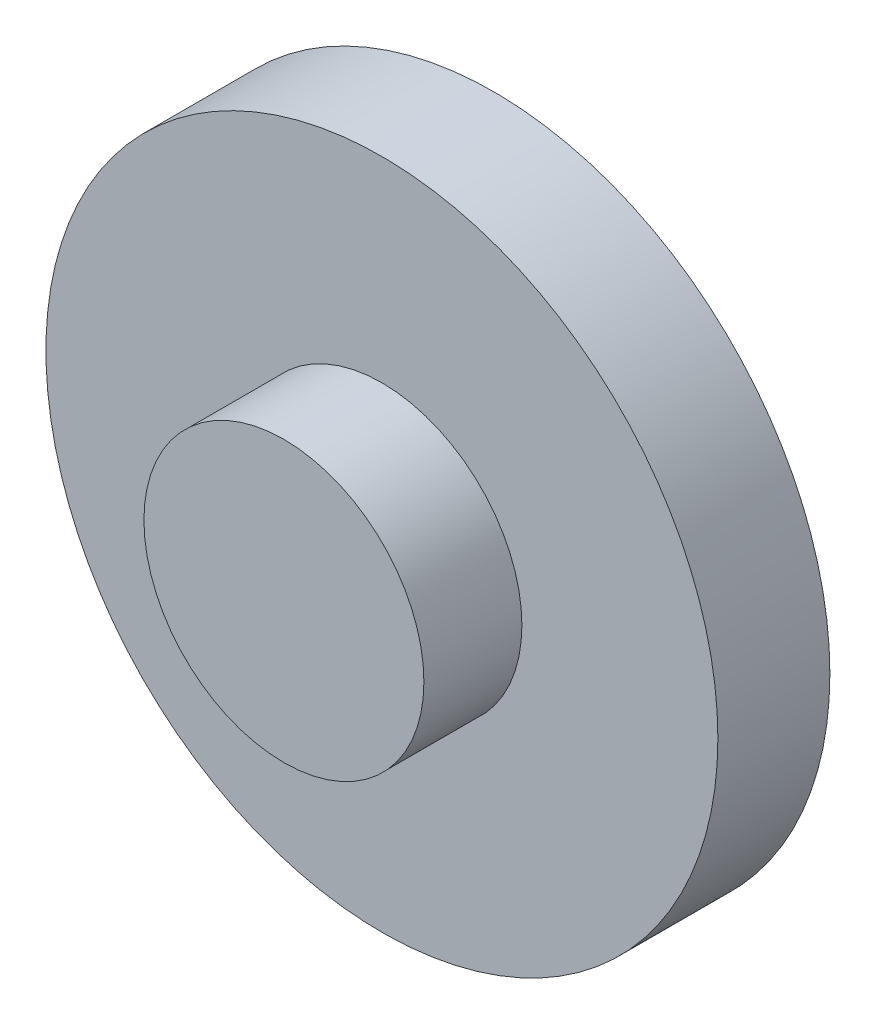
ISO-10303-21;
HEADER;
FILE_DESCRIPTION(('STEP AP214'),'2;1');
FILE_NAME('part.step','',(''),(''),'','','');
FILE_SCHEMA(('AUTOMOTIVE_DESIGN { 1 0 10303 214 1 1 1 1 }'));
ENDSEC;
DATA;
#1=APPLICATION_CONTEXT('core data for automotive mechanical design processes');
#2=APPLICATION_PROTOCOL_DEFINITION('international standard','automotive_design',2000,#1);
#3=PRODUCT_CONTEXT('',#1,'mechanical');
#4=PRODUCT('Part','Part','',(#3));
#5=PRODUCT_RELATED_PRODUCT_CATEGORY('part','',(#4));
#6=PRODUCT_DEFINITION_FORMATION('','',#4);
#7=PRODUCT_DEFINITION_CONTEXT('part definition',#1,'design');
#8=PRODUCT_DEFINITION('design','',#6,#7);
#9=PRODUCT_DEFINITION_SHAPE('','',#8);
#10=(LENGTH_UNIT() NAMED_UNIT(*) SI_UNIT(.MILLI.,.METRE.));
#11=(NAMED_UNIT(*) PLANE_ANGLE_UNIT() SI_UNIT($,.RADIAN.));
#12=(NAMED_UNIT(*) SI_UNIT($,.STERADIAN.) SOLID_ANGLE_UNIT());
#13=UNCERTAINTY_MEASURE_WITH_UNIT(LENGTH_MEASURE(1.E-05),#10,'distance_accuracy_value','');
#14=(GEOMETRIC_REPRESENTATION_CONTEXT(3) GLOBAL_UNCERTAINTY_ASSIGNED_CONTEXT((#13)) GLOBAL_UNIT_ASSIGNED_CONTEXT((#10,
#11,#12)) REPRESENTATION_CONTEXT('',''));
#15=CARTESIAN_POINT('',(0.,0.,0.));
#16=DIRECTION('',(0.,0.,1.));
#17=DIRECTION('',(1.,0.,0.));
#18=AXIS2_PLACEMENT_3D('',#15,#16,#17);
#19=CARTESIAN_POINT('',(0.,0.,25.4));
#20=DIRECTION('',(0.,0.,1.));
#21=DIRECTION('',(1.,0.,0.));
#22=AXIS2_PLACEMENT_3D('',#19,#20,#21);
#23=PLANE('',#22);
#24=CARTESIAN_POINT('',(0.,0.,25.4));
#25=DIRECTION('',(0.,0.,1.));
#26=DIRECTION('',(1.,0.,0.));
#27=AXIS2_PLACEMENT_3D('',#24,#25,#26);
#28=CIRCLE('',#27,31.75);
#29=CARTESIAN_POINT('',(31.75,0.,25.4));
#30=VERTEX_POINT('',#29);
#31=EDGE_CURVE('E50',#30,#30,#28,.T.);
#32=ORIENTED_EDGE('',*,*,#31,.F.);
#33=EDGE_LOOP('',(#32));
#34=FACE_BOUND('',#33,.T.);
#35=CARTESIAN_POINT('',(0.,0.,25.4));
#36=DIRECTION('',(0.,0.,1.));
#37=DIRECTION('',(1.,0.,0.));
#38=AXIS2_PLACEMENT_3D('',#35,#36,#37);
#39=CIRCLE('',#38,76.2);
#40=CARTESIAN_POINT('',(76.2,0.,25.4));
#41=VERTEX_POINT('',#40);
#42=EDGE_CURVE('E10',#41,#41,#39,.T.);
#43=ORIENTED_EDGE('',*,*,#42,.T.);
#44=EDGE_LOOP('',(#43));
#45=FACE_BOUND('',#44,.T.);
#46=ADVANCED_FACE('F31',(#34,#45),#23,.T.);
#47=CARTESIAN_POINT('',(0.,0.,0.));
#48=DIRECTION('',(0.,0.,1.));
#49=DIRECTION('',(1.,0.,0.));
#50=AXIS2_PLACEMENT_3D('',#47,#48,#49);
#51=PLANE('',#50);
#52=CARTESIAN_POINT('',(0.,0.,0.));
#53=DIRECTION('',(0.,0.,1.));
#54=DIRECTION('',(1.,0.,0.));
#55=AXIS2_PLACEMENT_3D('',#52,#53,#54);
#56=CIRCLE('',#55,76.2);
#57=CARTESIAN_POINT('',(76.2,0.,0.));
#58=VERTEX_POINT('',#57);
#59=EDGE_CURVE('E35',#58,#58,#56,.T.);
#60=ORIENTED_EDGE('',*,*,#59,.F.);
#61=EDGE_LOOP('',(#60));
#62=FACE_BOUND('',#61,.T.);
#63=CARTESIAN_POINT('',(0.,0.,0.));
#64=DIRECTION('',(0.,0.,1.));
#65=DIRECTION('',(1.,0.,0.));
#66=AXIS2_PLACEMENT_3D('',#63,#64,#65);
#67=CIRCLE('',#66,15.875);
#68=CARTESIAN_POINT('',(15.875,0.,0.));
#69=VERTEX_POINT('',#68);
#70=EDGE_CURVE('E42',#69,#69,#67,.T.);
#71=ORIENTED_EDGE('',*,*,#70,.T.);
#72=EDGE_LOOP('',(#71));
#73=FACE_BOUND('',#72,.T.);
#74=ADVANCED_FACE('F66',(#62,#73),#51,.F.);
#75=CARTESIAN_POINT('',(0.,0.,25.4));
#76=DIRECTION('',(0.,0.,-1.));
#77=DIRECTION('',(-1.,0.,0.));
#78=AXIS2_PLACEMENT_3D('',#75,#76,#77);
#79=CYLINDRICAL_SURFACE('',#78,76.2);
#80=ORIENTED_EDGE('',*,*,#42,.F.);
#81=EDGE_LOOP('',(#80));
#82=FACE_BOUND('',#81,.T.);
#83=ORIENTED_EDGE('',*,*,#59,.T.);
#84=EDGE_LOOP('',(#83));
#85=FACE_BOUND('',#84,.T.);
#86=ADVANCED_FACE('F33',(#82,#85),#79,.T.);
#87=CARTESIAN_POINT('',(0.,0.,25.4));
#88=DIRECTION('',(0.,0.,-1.));
#89=DIRECTION('',(-1.,0.,0.));
#90=AXIS2_PLACEMENT_3D('',#87,#88,#89);
#91=CYLINDRICAL_SURFACE('',#90,15.875);
#92=CARTESIAN_POINT('',(0.,0.,25.4));
#93=DIRECTION('',(0.,0.,1.));
#94=DIRECTION('',(1.,0.,0.));
#95=AXIS2_PLACEMENT_3D('',#92,#93,#94);
#96=CIRCLE('',#95,15.875);
#97=CARTESIAN_POINT('',(15.875,0.,25.4));
#98=VERTEX_POINT('',#97);
#99=EDGE_CURVE('E46',#98,#98,#96,.T.);
#100=ORIENTED_EDGE('',*,*,#99,.T.);
#101=EDGE_LOOP('',(#100));
#102=FACE_BOUND('',#101,.T.);
#103=ORIENTED_EDGE('',*,*,#70,.F.);
#104=EDGE_LOOP('',(#103));
#105=FACE_BOUND('',#104,.T.);
#106=ADVANCED_FACE('F75',(#102,#105),#91,.F.);
#107=CARTESIAN_POINT('',(0.,0.,25.4));
#108=DIRECTION('',(0.,0.,1.));
#109=DIRECTION('',(1.,0.,0.));
#110=AXIS2_PLACEMENT_3D('',#107,#108,#109);
#111=PLANE('',#110);
#112=ORIENTED_EDGE('',*,*,#99,.F.);
#113=EDGE_LOOP('',(#112));
#114=FACE_BOUND('',#113,.T.);
#115=ADVANCED_FACE('F61',(#114),#111,.F.);
#116=CARTESIAN_POINT('',(0.,0.,47.625));
#117=DIRECTION('',(0.,0.,-1.));
#118=DIRECTION('',(-1.,0.,0.));
#119=AXIS2_PLACEMENT_3D('',#116,#117,#118);
#120=CYLINDRICAL_SURFACE('',#119,31.75);
#121=CARTESIAN_POINT('',(0.,0.,47.625));
#122=DIRECTION('',(0.,0.,1.));
#123=DIRECTION('',(1.,0.,0.));
#124=AXIS2_PLACEMENT_3D('',#121,#122,#123);
#125=CIRCLE('',#124,31.75);
#126=CARTESIAN_POINT('',(31.75,0.,47.625));
#127=VERTEX_POINT('',#126);
#128=EDGE_CURVE('E49',#127,#127,#125,.T.);
#129=ORIENTED_EDGE('',*,*,#128,.F.);
#130=EDGE_LOOP('',(#129));
#131=FACE_BOUND('',#130,.T.);
#132=ORIENTED_EDGE('',*,*,#31,.T.);
#133=EDGE_LOOP('',(#132));
#134=FACE_BOUND('',#133,.T.);
#135=ADVANCED_FACE('F58',(#131,#134),#120,.T.);
#136=CARTESIAN_POINT('',(0.,0.,47.625));
#137=DIRECTION('',(0.,0.,1.));
#138=DIRECTION('',(1.,0.,0.));
#139=AXIS2_PLACEMENT_3D('',#136,#137,#138);
#140=PLANE('',#139);
#141=ORIENTED_EDGE('',*,*,#128,.T.);
#142=EDGE_LOOP('',(#141));
#143=FACE_BOUND('',#142,.T.);
#144=ADVANCED_FACE('F56',(#143),#140,.T.);
#145=CLOSED_SHELL('',(#46,#74,#86,#106,#115,#135,#144));
#146=MANIFOLD_SOLID_BREP('B2',#145);
#147=ADVANCED_BREP_SHAPE_REPRESENTATION('',(#18,#146),#14);
#148=SHAPE_DEFINITION_REPRESENTATION(#9,#147);
ENDSEC;
END-ISO-10303-21;
